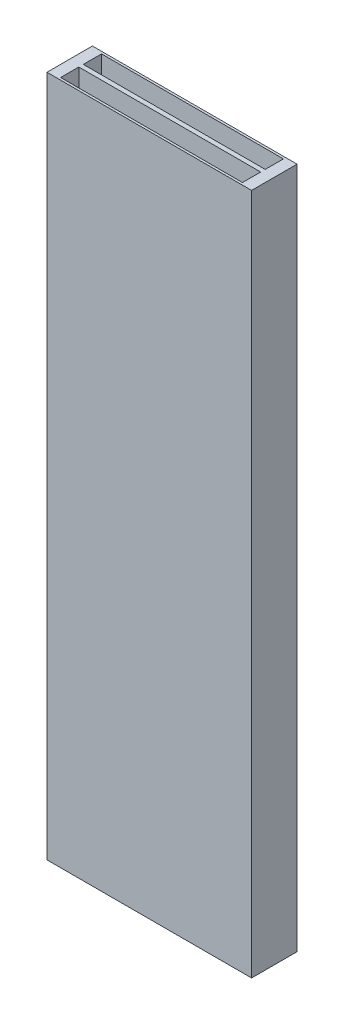
ISO-10303-21;
HEADER;
FILE_DESCRIPTION(('STEP AP214'),'2;1');
FILE_NAME('part.step','',(''),(''),'','','');
FILE_SCHEMA(('AUTOMOTIVE_DESIGN { 1 0 10303 214 1 1 1 1 }'));
ENDSEC;
DATA;
#1=APPLICATION_CONTEXT('core data for automotive mechanical design processes');
#2=APPLICATION_PROTOCOL_DEFINITION('international standard','automotive_design',2000,#1);
#3=PRODUCT_CONTEXT('',#1,'mechanical');
#4=PRODUCT('Part','Part','',(#3));
#5=PRODUCT_RELATED_PRODUCT_CATEGORY('part','',(#4));
#6=PRODUCT_DEFINITION_FORMATION('','',#4);
#7=PRODUCT_DEFINITION_CONTEXT('part definition',#1,'design');
#8=PRODUCT_DEFINITION('design','',#6,#7);
#9=PRODUCT_DEFINITION_SHAPE('','',#8);
#10=(LENGTH_UNIT() NAMED_UNIT(*) SI_UNIT(.MILLI.,.METRE.));
#11=(NAMED_UNIT(*) PLANE_ANGLE_UNIT() SI_UNIT($,.RADIAN.));
#12=(NAMED_UNIT(*) SI_UNIT($,.STERADIAN.) SOLID_ANGLE_UNIT());
#13=UNCERTAINTY_MEASURE_WITH_UNIT(LENGTH_MEASURE(1.E-05),#10,'distance_accuracy_value','');
#14=(GEOMETRIC_REPRESENTATION_CONTEXT(3) GLOBAL_UNCERTAINTY_ASSIGNED_CONTEXT((#13)) GLOBAL_UNIT_ASSIGNED_CONTEXT((#10,
#11,#12)) REPRESENTATION_CONTEXT('',''));
#15=CARTESIAN_POINT('',(0.,0.,0.));
#16=DIRECTION('',(0.,0.,1.));
#17=DIRECTION('',(1.,0.,0.));
#18=AXIS2_PLACEMENT_3D('',#15,#16,#17);
#19=CARTESIAN_POINT('',(0.,15.,0.));
#20=DIRECTION('',(0.,-1.,0.));
#21=DIRECTION('',(0.,0.,-1.));
#22=AXIS2_PLACEMENT_3D('',#19,#20,#21);
#23=PLANE('',#22);
#24=DIRECTION('',(0.,0.,-1.));
#25=VECTOR('',#24,1.);
#26=CARTESIAN_POINT('',(4.5,15.,1.));
#27=LINE('',#26,#25);
#28=CARTESIAN_POINT('',(4.5,15.,1.));
#29=VERTEX_POINT('',#28);
#30=CARTESIAN_POINT('',(4.5,15.,-1.));
#31=VERTEX_POINT('',#30);
#32=EDGE_CURVE('E222',#29,#31,#27,.T.);
#33=ORIENTED_EDGE('',*,*,#32,.T.);
#34=DIRECTION('',(-1.,0.,0.));
#35=VECTOR('',#34,1.);
#36=CARTESIAN_POINT('',(-4.5,15.,-1.));
#37=LINE('',#36,#35);
#38=CARTESIAN_POINT('',(-4.5,15.,-1.));
#39=VERTEX_POINT('',#38);
#40=EDGE_CURVE('E226',#31,#39,#37,.T.);
#41=ORIENTED_EDGE('',*,*,#40,.T.);
#42=DIRECTION('',(0.,0.,1.));
#43=VECTOR('',#42,1.);
#44=CARTESIAN_POINT('',(-4.5,15.,1.));
#45=LINE('',#44,#43);
#46=CARTESIAN_POINT('',(-4.5,15.,1.));
#47=VERTEX_POINT('',#46);
#48=EDGE_CURVE('E230',#39,#47,#45,.T.);
#49=ORIENTED_EDGE('',*,*,#48,.T.);
#50=DIRECTION('',(1.,0.,0.));
#51=VECTOR('',#50,1.);
#52=CARTESIAN_POINT('',(-4.5,15.,1.));
#53=LINE('',#52,#51);
#54=EDGE_CURVE('E233',#47,#29,#53,.T.);
#55=ORIENTED_EDGE('',*,*,#54,.T.);
#56=EDGE_LOOP('',(#33,#41,#49,#55));
#57=FACE_BOUND('',#56,.T.);
#58=DIRECTION('',(1.,0.,0.));
#59=VECTOR('',#58,1.);
#60=CARTESIAN_POINT('',(0.,15.,-0.9));
#61=LINE('',#60,#59);
#62=CARTESIAN_POINT('',(-4.,15.,-0.9));
#63=VERTEX_POINT('',#62);
#64=CARTESIAN_POINT('',(4.,15.,-0.9));
#65=VERTEX_POINT('',#64);
#66=EDGE_CURVE('E195',#63,#65,#61,.T.);
#67=ORIENTED_EDGE('',*,*,#66,.T.);
#68=DIRECTION('',(0.,0.,1.));
#69=VECTOR('',#68,1.);
#70=CARTESIAN_POINT('',(4.,15.,0.));
#71=LINE('',#70,#69);
#72=CARTESIAN_POINT('',(4.,15.,-0.1));
#73=VERTEX_POINT('',#72);
#74=EDGE_CURVE('E217',#65,#73,#71,.T.);
#75=ORIENTED_EDGE('',*,*,#74,.T.);
#76=DIRECTION('',(-1.,0.,0.));
#77=VECTOR('',#76,1.);
#78=CARTESIAN_POINT('',(0.,15.,-0.1));
#79=LINE('',#78,#77);
#80=CARTESIAN_POINT('',(-4.,15.,-0.1));
#81=VERTEX_POINT('',#80);
#82=EDGE_CURVE('E213',#73,#81,#79,.T.);
#83=ORIENTED_EDGE('',*,*,#82,.T.);
#84=DIRECTION('',(0.,0.,-1.));
#85=VECTOR('',#84,1.);
#86=CARTESIAN_POINT('',(-4.,15.,0.));
#87=LINE('',#86,#85);
#88=EDGE_CURVE('E209',#81,#63,#87,.T.);
#89=ORIENTED_EDGE('',*,*,#88,.T.);
#90=EDGE_LOOP('',(#67,#75,#83,#89));
#91=FACE_BOUND('',#90,.T.);
#92=DIRECTION('',(0.,0.,-1.));
#93=VECTOR('',#92,1.);
#94=CARTESIAN_POINT('',(4.,15.,0.));
#95=LINE('',#94,#93);
#96=CARTESIAN_POINT('',(4.,15.,0.9));
#97=VERTEX_POINT('',#96);
#98=CARTESIAN_POINT('',(4.,15.,0.1));
#99=VERTEX_POINT('',#98);
#100=EDGE_CURVE('E140',#97,#99,#95,.T.);
#101=ORIENTED_EDGE('',*,*,#100,.F.);
#102=DIRECTION('',(1.,0.,0.));
#103=VECTOR('',#102,1.);
#104=CARTESIAN_POINT('',(0.,15.,0.9));
#105=LINE('',#104,#103);
#106=CARTESIAN_POINT('',(-4.,15.,0.9));
#107=VERTEX_POINT('',#106);
#108=EDGE_CURVE('E169',#107,#97,#105,.T.);
#109=ORIENTED_EDGE('',*,*,#108,.F.);
#110=DIRECTION('',(0.,0.,1.));
#111=VECTOR('',#110,1.);
#112=CARTESIAN_POINT('',(-4.,15.,0.));
#113=LINE('',#112,#111);
#114=CARTESIAN_POINT('',(-4.,15.,0.1));
#115=VERTEX_POINT('',#114);
#116=EDGE_CURVE('E166',#115,#107,#113,.T.);
#117=ORIENTED_EDGE('',*,*,#116,.F.);
#118=DIRECTION('',(-1.,0.,0.));
#119=VECTOR('',#118,1.);
#120=CARTESIAN_POINT('',(0.,15.,0.1));
#121=LINE('',#120,#119);
#122=EDGE_CURVE('E157',#99,#115,#121,.T.);
#123=ORIENTED_EDGE('',*,*,#122,.F.);
#124=EDGE_LOOP('',(#101,#109,#117,#123));
#125=FACE_BOUND('',#124,.T.);
#126=ADVANCED_FACE('F39',(#57,#91,#125),#23,.F.);
#127=CARTESIAN_POINT('',(0.,-15.,0.));
#128=DIRECTION('',(0.,-1.,0.));
#129=DIRECTION('',(0.,0.,-1.));
#130=AXIS2_PLACEMENT_3D('',#127,#128,#129);
#131=PLANE('',#130);
#132=DIRECTION('',(0.,0.,-1.));
#133=VECTOR('',#132,1.);
#134=CARTESIAN_POINT('',(4.,-15.,-0.1));
#135=LINE('',#134,#133);
#136=CARTESIAN_POINT('',(4.,-15.,-0.1));
#137=VERTEX_POINT('',#136);
#138=CARTESIAN_POINT('',(4.,-15.,-0.9));
#139=VERTEX_POINT('',#138);
#140=EDGE_CURVE('E174',#137,#139,#135,.T.);
#141=ORIENTED_EDGE('',*,*,#140,.T.);
#142=DIRECTION('',(-1.,0.,0.));
#143=VECTOR('',#142,1.);
#144=CARTESIAN_POINT('',(-4.,-15.,-0.9));
#145=LINE('',#144,#143);
#146=CARTESIAN_POINT('',(-4.,-15.,-0.9));
#147=VERTEX_POINT('',#146);
#148=EDGE_CURVE('E178',#139,#147,#145,.T.);
#149=ORIENTED_EDGE('',*,*,#148,.T.);
#150=DIRECTION('',(0.,0.,1.));
#151=VECTOR('',#150,1.);
#152=CARTESIAN_POINT('',(-4.,-15.,-0.1));
#153=LINE('',#152,#151);
#154=CARTESIAN_POINT('',(-4.,-15.,-0.1));
#155=VERTEX_POINT('',#154);
#156=EDGE_CURVE('E182',#147,#155,#153,.T.);
#157=ORIENTED_EDGE('',*,*,#156,.T.);
#158=DIRECTION('',(1.,0.,0.));
#159=VECTOR('',#158,1.);
#160=CARTESIAN_POINT('',(-4.,-15.,-0.1));
#161=LINE('',#160,#159);
#162=EDGE_CURVE('E186',#155,#137,#161,.T.);
#163=ORIENTED_EDGE('',*,*,#162,.T.);
#164=EDGE_LOOP('',(#141,#149,#157,#163));
#165=FACE_BOUND('',#164,.T.);
#166=DIRECTION('',(0.,0.,-1.));
#167=VECTOR('',#166,1.);
#168=CARTESIAN_POINT('',(4.5,-15.,1.));
#169=LINE('',#168,#167);
#170=CARTESIAN_POINT('',(4.5,-15.,1.));
#171=VERTEX_POINT('',#170);
#172=CARTESIAN_POINT('',(4.5,-15.,-1.));
#173=VERTEX_POINT('',#172);
#174=EDGE_CURVE('E221',#171,#173,#169,.T.);
#175=ORIENTED_EDGE('',*,*,#174,.F.);
#176=DIRECTION('',(1.,0.,0.));
#177=VECTOR('',#176,1.);
#178=CARTESIAN_POINT('',(-4.5,-15.,1.));
#179=LINE('',#178,#177);
#180=CARTESIAN_POINT('',(-4.5,-15.,1.));
#181=VERTEX_POINT('',#180);
#182=EDGE_CURVE('E227',#181,#171,#179,.T.);
#183=ORIENTED_EDGE('',*,*,#182,.F.);
#184=DIRECTION('',(0.,0.,1.));
#185=VECTOR('',#184,1.);
#186=CARTESIAN_POINT('',(-4.5,-15.,1.));
#187=LINE('',#186,#185);
#188=CARTESIAN_POINT('',(-4.5,-15.,-1.));
#189=VERTEX_POINT('',#188);
#190=EDGE_CURVE('E243',#189,#181,#187,.T.);
#191=ORIENTED_EDGE('',*,*,#190,.F.);
#192=DIRECTION('',(-1.,0.,0.));
#193=VECTOR('',#192,1.);
#194=CARTESIAN_POINT('',(-4.5,-15.,-1.));
#195=LINE('',#194,#193);
#196=EDGE_CURVE('E240',#173,#189,#195,.T.);
#197=ORIENTED_EDGE('',*,*,#196,.F.);
#198=EDGE_LOOP('',(#175,#183,#191,#197));
#199=FACE_BOUND('',#198,.T.);
#200=DIRECTION('',(-1.,0.,0.));
#201=VECTOR('',#200,1.);
#202=CARTESIAN_POINT('',(-4.,-15.,0.9));
#203=LINE('',#202,#201);
#204=CARTESIAN_POINT('',(4.,-15.,0.9));
#205=VERTEX_POINT('',#204);
#206=CARTESIAN_POINT('',(-4.,-15.,0.9));
#207=VERTEX_POINT('',#206);
#208=EDGE_CURVE('E143',#205,#207,#203,.T.);
#209=ORIENTED_EDGE('',*,*,#208,.F.);
#210=DIRECTION('',(0.,0.,1.));
#211=VECTOR('',#210,1.);
#212=CARTESIAN_POINT('',(4.,-15.,0.1));
#213=LINE('',#212,#211);
#214=CARTESIAN_POINT('',(4.,-15.,0.1));
#215=VERTEX_POINT('',#214);
#216=EDGE_CURVE('E133',#215,#205,#213,.T.);
#217=ORIENTED_EDGE('',*,*,#216,.F.);
#218=DIRECTION('',(1.,0.,0.));
#219=VECTOR('',#218,1.);
#220=CARTESIAN_POINT('',(-4.,-15.,0.1));
#221=LINE('',#220,#219);
#222=CARTESIAN_POINT('',(-4.,-15.,0.1));
#223=VERTEX_POINT('',#222);
#224=EDGE_CURVE('E126',#223,#215,#221,.T.);
#225=ORIENTED_EDGE('',*,*,#224,.F.);
#226=DIRECTION('',(0.,0.,-1.));
#227=VECTOR('',#226,1.);
#228=CARTESIAN_POINT('',(-4.,-15.,0.1));
#229=LINE('',#228,#227);
#230=EDGE_CURVE('E132',#207,#223,#229,.T.);
#231=ORIENTED_EDGE('',*,*,#230,.F.);
#232=EDGE_LOOP('',(#209,#217,#225,#231));
#233=FACE_BOUND('',#232,.T.);
#234=ADVANCED_FACE('F146',(#165,#199,#233),#131,.T.);
#235=CARTESIAN_POINT('',(4.5,15.,1.));
#236=DIRECTION('',(-1.,0.,0.));
#237=DIRECTION('',(0.,0.,1.));
#238=AXIS2_PLACEMENT_3D('',#235,#236,#237);
#239=PLANE('',#238);
#240=ORIENTED_EDGE('',*,*,#174,.T.);
#241=DIRECTION('',(0.,-1.,0.));
#242=VECTOR('',#241,1.);
#243=CARTESIAN_POINT('',(4.5,15.,-1.));
#244=LINE('',#243,#242);
#245=EDGE_CURVE('E11',#31,#173,#244,.T.);
#246=ORIENTED_EDGE('',*,*,#245,.F.);
#247=ORIENTED_EDGE('',*,*,#32,.F.);
#248=DIRECTION('',(0.,-1.,0.));
#249=VECTOR('',#248,1.);
#250=CARTESIAN_POINT('',(4.5,15.,1.));
#251=LINE('',#250,#249);
#252=EDGE_CURVE('E236',#29,#171,#251,.T.);
#253=ORIENTED_EDGE('',*,*,#252,.T.);
#254=EDGE_LOOP('',(#240,#246,#247,#253));
#255=FACE_BOUND('',#254,.T.);
#256=ADVANCED_FACE('F41',(#255),#239,.F.);
#257=CARTESIAN_POINT('',(-4.5,15.,-1.));
#258=DIRECTION('',(0.,0.,1.));
#259=DIRECTION('',(1.,0.,0.));
#260=AXIS2_PLACEMENT_3D('',#257,#258,#259);
#261=PLANE('',#260);
#262=ORIENTED_EDGE('',*,*,#196,.T.);
#263=DIRECTION('',(0.,-1.,0.));
#264=VECTOR('',#263,1.);
#265=CARTESIAN_POINT('',(-4.5,15.,-1.));
#266=LINE('',#265,#264);
#267=EDGE_CURVE('E48',#39,#189,#266,.T.);
#268=ORIENTED_EDGE('',*,*,#267,.F.);
#269=ORIENTED_EDGE('',*,*,#40,.F.);
#270=ORIENTED_EDGE('',*,*,#245,.T.);
#271=EDGE_LOOP('',(#262,#268,#269,#270));
#272=FACE_BOUND('',#271,.T.);
#273=ADVANCED_FACE('F275',(#272),#261,.F.);
#274=CARTESIAN_POINT('',(-4.5,15.,1.));
#275=DIRECTION('',(1.,0.,0.));
#276=DIRECTION('',(0.,0.,-1.));
#277=AXIS2_PLACEMENT_3D('',#274,#275,#276);
#278=PLANE('',#277);
#279=ORIENTED_EDGE('',*,*,#190,.T.);
#280=DIRECTION('',(0.,-1.,0.));
#281=VECTOR('',#280,1.);
#282=CARTESIAN_POINT('',(-4.5,15.,1.));
#283=LINE('',#282,#281);
#284=EDGE_CURVE('E251',#47,#181,#283,.T.);
#285=ORIENTED_EDGE('',*,*,#284,.F.);
#286=ORIENTED_EDGE('',*,*,#48,.F.);
#287=ORIENTED_EDGE('',*,*,#267,.T.);
#288=EDGE_LOOP('',(#279,#285,#286,#287));
#289=FACE_BOUND('',#288,.T.);
#290=ADVANCED_FACE('F260',(#289),#278,.F.);
#291=CARTESIAN_POINT('',(-4.5,15.,1.));
#292=DIRECTION('',(0.,0.,-1.));
#293=DIRECTION('',(-1.,0.,0.));
#294=AXIS2_PLACEMENT_3D('',#291,#292,#293);
#295=PLANE('',#294);
#296=ORIENTED_EDGE('',*,*,#182,.T.);
#297=ORIENTED_EDGE('',*,*,#252,.F.);
#298=ORIENTED_EDGE('',*,*,#54,.F.);
#299=ORIENTED_EDGE('',*,*,#284,.T.);
#300=EDGE_LOOP('',(#296,#297,#298,#299));
#301=FACE_BOUND('',#300,.T.);
#302=ADVANCED_FACE('F268',(#301),#295,.F.);
#303=CARTESIAN_POINT('',(4.,-15.,-0.1));
#304=DIRECTION('',(1.,0.,0.));
#305=DIRECTION('',(0.,0.,-1.));
#306=AXIS2_PLACEMENT_3D('',#303,#304,#305);
#307=PLANE('',#306);
#308=DIRECTION('',(0.,1.,0.));
#309=VECTOR('',#308,1.);
#310=CARTESIAN_POINT('',(4.,-15.,-0.9));
#311=LINE('',#310,#309);
#312=EDGE_CURVE('E190',#139,#65,#311,.T.);
#313=ORIENTED_EDGE('',*,*,#312,.F.);
#314=ORIENTED_EDGE('',*,*,#140,.F.);
#315=DIRECTION('',(0.,1.,0.));
#316=VECTOR('',#315,1.);
#317=CARTESIAN_POINT('',(4.,-15.,-0.1));
#318=LINE('',#317,#316);
#319=EDGE_CURVE('E191',#137,#73,#318,.T.);
#320=ORIENTED_EDGE('',*,*,#319,.T.);
#321=ORIENTED_EDGE('',*,*,#74,.F.);
#322=EDGE_LOOP('',(#313,#314,#320,#321));
#323=FACE_BOUND('',#322,.T.);
#324=ADVANCED_FACE('F290',(#323),#307,.F.);
#325=CARTESIAN_POINT('',(-4.,-15.,-0.1));
#326=DIRECTION('',(0.,0.,1.));
#327=DIRECTION('',(1.,0.,0.));
#328=AXIS2_PLACEMENT_3D('',#325,#326,#327);
#329=PLANE('',#328);
#330=ORIENTED_EDGE('',*,*,#319,.F.);
#331=ORIENTED_EDGE('',*,*,#162,.F.);
#332=DIRECTION('',(0.,1.,0.));
#333=VECTOR('',#332,1.);
#334=CARTESIAN_POINT('',(-4.,-15.,-0.1));
#335=LINE('',#334,#333);
#336=EDGE_CURVE('E196',#155,#81,#335,.T.);
#337=ORIENTED_EDGE('',*,*,#336,.T.);
#338=ORIENTED_EDGE('',*,*,#82,.F.);
#339=EDGE_LOOP('',(#330,#331,#337,#338));
#340=FACE_BOUND('',#339,.T.);
#341=ADVANCED_FACE('F297',(#340),#329,.F.);
#342=CARTESIAN_POINT('',(-4.,-15.,-0.1));
#343=DIRECTION('',(-1.,0.,0.));
#344=DIRECTION('',(0.,0.,1.));
#345=AXIS2_PLACEMENT_3D('',#342,#343,#344);
#346=PLANE('',#345);
#347=ORIENTED_EDGE('',*,*,#336,.F.);
#348=ORIENTED_EDGE('',*,*,#156,.F.);
#349=DIRECTION('',(0.,1.,0.));
#350=VECTOR('',#349,1.);
#351=CARTESIAN_POINT('',(-4.,-15.,-0.9));
#352=LINE('',#351,#350);
#353=EDGE_CURVE('E200',#147,#63,#352,.T.);
#354=ORIENTED_EDGE('',*,*,#353,.T.);
#355=ORIENTED_EDGE('',*,*,#88,.F.);
#356=EDGE_LOOP('',(#347,#348,#354,#355));
#357=FACE_BOUND('',#356,.T.);
#358=ADVANCED_FACE('F302',(#357),#346,.F.);
#359=CARTESIAN_POINT('',(-4.,-15.,-0.9));
#360=DIRECTION('',(0.,0.,-1.));
#361=DIRECTION('',(-1.,0.,0.));
#362=AXIS2_PLACEMENT_3D('',#359,#360,#361);
#363=PLANE('',#362);
#364=ORIENTED_EDGE('',*,*,#353,.F.);
#365=ORIENTED_EDGE('',*,*,#148,.F.);
#366=ORIENTED_EDGE('',*,*,#312,.T.);
#367=ORIENTED_EDGE('',*,*,#66,.F.);
#368=EDGE_LOOP('',(#364,#365,#366,#367));
#369=FACE_BOUND('',#368,.T.);
#370=ADVANCED_FACE('F310',(#369),#363,.F.);
#371=CARTESIAN_POINT('',(4.,-15.,0.1));
#372=DIRECTION('',(-1.,0.,0.));
#373=DIRECTION('',(0.,0.,1.));
#374=AXIS2_PLACEMENT_3D('',#371,#372,#373);
#375=PLANE('',#374);
#376=ORIENTED_EDGE('',*,*,#100,.T.);
#377=DIRECTION('',(0.,1.,0.));
#378=VECTOR('',#377,1.);
#379=CARTESIAN_POINT('',(4.,-15.,0.1));
#380=LINE('',#379,#378);
#381=EDGE_CURVE('E55',#215,#99,#380,.T.);
#382=ORIENTED_EDGE('',*,*,#381,.F.);
#383=ORIENTED_EDGE('',*,*,#216,.T.);
#384=DIRECTION('',(0.,1.,0.));
#385=VECTOR('',#384,1.);
#386=CARTESIAN_POINT('',(4.,-15.,0.9));
#387=LINE('',#386,#385);
#388=EDGE_CURVE('E154',#205,#97,#387,.T.);
#389=ORIENTED_EDGE('',*,*,#388,.T.);
#390=EDGE_LOOP('',(#376,#382,#383,#389));
#391=FACE_BOUND('',#390,.T.);
#392=ADVANCED_FACE('F136',(#391),#375,.T.);
#393=CARTESIAN_POINT('',(-4.,-15.,0.9));
#394=DIRECTION('',(0.,0.,-1.));
#395=DIRECTION('',(-1.,0.,0.));
#396=AXIS2_PLACEMENT_3D('',#393,#394,#395);
#397=PLANE('',#396);
#398=ORIENTED_EDGE('',*,*,#108,.T.);
#399=ORIENTED_EDGE('',*,*,#388,.F.);
#400=ORIENTED_EDGE('',*,*,#208,.T.);
#401=DIRECTION('',(0.,1.,0.));
#402=VECTOR('',#401,1.);
#403=CARTESIAN_POINT('',(-4.,-15.,0.9));
#404=LINE('',#403,#402);
#405=EDGE_CURVE('E158',#207,#107,#404,.T.);
#406=ORIENTED_EDGE('',*,*,#405,.T.);
#407=EDGE_LOOP('',(#398,#399,#400,#406));
#408=FACE_BOUND('',#407,.T.);
#409=ADVANCED_FACE('F322',(#408),#397,.T.);
#410=CARTESIAN_POINT('',(-4.,-15.,0.1));
#411=DIRECTION('',(1.,0.,0.));
#412=DIRECTION('',(0.,0.,-1.));
#413=AXIS2_PLACEMENT_3D('',#410,#411,#412);
#414=PLANE('',#413);
#415=ORIENTED_EDGE('',*,*,#116,.T.);
#416=ORIENTED_EDGE('',*,*,#405,.F.);
#417=ORIENTED_EDGE('',*,*,#230,.T.);
#418=DIRECTION('',(0.,1.,0.));
#419=VECTOR('',#418,1.);
#420=CARTESIAN_POINT('',(-4.,-15.,0.1));
#421=LINE('',#420,#419);
#422=EDGE_CURVE('E60',#223,#115,#421,.T.);
#423=ORIENTED_EDGE('',*,*,#422,.T.);
#424=EDGE_LOOP('',(#415,#416,#417,#423));
#425=FACE_BOUND('',#424,.T.);
#426=ADVANCED_FACE('F325',(#425),#414,.T.);
#427=CARTESIAN_POINT('',(-4.,-15.,0.1));
#428=DIRECTION('',(0.,0.,1.));
#429=DIRECTION('',(1.,0.,0.));
#430=AXIS2_PLACEMENT_3D('',#427,#428,#429);
#431=PLANE('',#430);
#432=ORIENTED_EDGE('',*,*,#122,.T.);
#433=ORIENTED_EDGE('',*,*,#422,.F.);
#434=ORIENTED_EDGE('',*,*,#224,.T.);
#435=ORIENTED_EDGE('',*,*,#381,.T.);
#436=EDGE_LOOP('',(#432,#433,#434,#435));
#437=FACE_BOUND('',#436,.T.);
#438=ADVANCED_FACE('F127',(#437),#431,.T.);
#439=CLOSED_SHELL('',(#126,#234,#256,#273,#290,#302,#324,#341,#358,#370,#392,#409,#426,#438));
#440=MANIFOLD_SOLID_BREP('B2',#439);
#441=ADVANCED_BREP_SHAPE_REPRESENTATION('',(#18,#440),#14);
#442=SHAPE_DEFINITION_REPRESENTATION(#9,#441);
ENDSEC;
END-ISO-10303-21;
